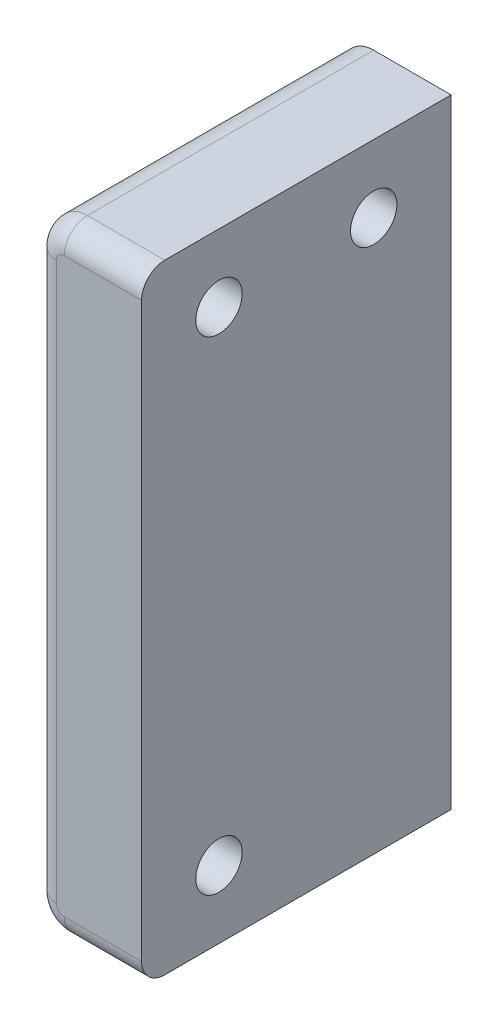
ISO-10303-21;
HEADER;
FILE_DESCRIPTION(('STEP AP214'),'2;1');
FILE_NAME('part.step','',(''),(''),'','','');
FILE_SCHEMA(('AUTOMOTIVE_DESIGN { 1 0 10303 214 1 1 1 1 }'));
ENDSEC;
DATA;
#1=APPLICATION_CONTEXT('core data for automotive mechanical design processes');
#2=APPLICATION_PROTOCOL_DEFINITION('international standard','automotive_design',2000,#1);
#3=PRODUCT_CONTEXT('',#1,'mechanical');
#4=PRODUCT('Part','Part','',(#3));
#5=PRODUCT_RELATED_PRODUCT_CATEGORY('part','',(#4));
#6=PRODUCT_DEFINITION_FORMATION('','',#4);
#7=PRODUCT_DEFINITION_CONTEXT('part definition',#1,'design');
#8=PRODUCT_DEFINITION('design','',#6,#7);
#9=PRODUCT_DEFINITION_SHAPE('','',#8);
#10=(LENGTH_UNIT() NAMED_UNIT(*) SI_UNIT(.MILLI.,.METRE.));
#11=(NAMED_UNIT(*) PLANE_ANGLE_UNIT() SI_UNIT($,.RADIAN.));
#12=(NAMED_UNIT(*) SI_UNIT($,.STERADIAN.) SOLID_ANGLE_UNIT());
#13=UNCERTAINTY_MEASURE_WITH_UNIT(LENGTH_MEASURE(1.E-05),#10,'distance_accuracy_value','');
#14=(GEOMETRIC_REPRESENTATION_CONTEXT(3) GLOBAL_UNCERTAINTY_ASSIGNED_CONTEXT((#13)) GLOBAL_UNIT_ASSIGNED_CONTEXT((#10,
#11,#12)) REPRESENTATION_CONTEXT('',''));
#15=CARTESIAN_POINT('',(0.,0.,0.));
#16=DIRECTION('',(0.,0.,1.));
#17=DIRECTION('',(1.,0.,0.));
#18=AXIS2_PLACEMENT_3D('',#15,#16,#17);
#19=CARTESIAN_POINT('',(-148.000000000001,-28.0000000000001,60.6078810084939));
#20=DIRECTION('',(-1.,0.,0.));
#21=DIRECTION('',(0.,0.,1.));
#22=AXIS2_PLACEMENT_3D('',#19,#20,#21);
#23=PLANE('',#22);
#24=CARTESIAN_POINT('',(-148.000000000001,-63.6250000000001,14.9999999999999));
#25=DIRECTION('',(1.,0.,0.));
#26=DIRECTION('',(0.,0.,-1.));
#27=AXIS2_PLACEMENT_3D('',#24,#25,#26);
#28=CIRCLE('',#27,1.49999999999999);
#29=CARTESIAN_POINT('',(-148.000000000001,-63.6250000000001,13.4999999999999));
#30=VERTEX_POINT('',#29);
#31=EDGE_CURVE('E153',#30,#30,#28,.T.);
#32=ORIENTED_EDGE('',*,*,#31,.F.);
#33=EDGE_LOOP('',(#32));
#34=FACE_BOUND('',#33,.T.);
#35=CARTESIAN_POINT('',(-148.000000000001,-32.3750000000001,5.));
#36=DIRECTION('',(1.,0.,0.));
#37=DIRECTION('',(0.,0.,-1.));
#38=AXIS2_PLACEMENT_3D('',#35,#36,#37);
#39=CIRCLE('',#38,1.50000000000006);
#40=CARTESIAN_POINT('',(-148.000000000001,-32.3750000000001,3.49999999999994));
#41=VERTEX_POINT('',#40);
#42=EDGE_CURVE('E193',#41,#41,#39,.T.);
#43=ORIENTED_EDGE('',*,*,#42,.F.);
#44=EDGE_LOOP('',(#43));
#45=FACE_BOUND('',#44,.T.);
#46=CARTESIAN_POINT('',(-148.000000000001,-32.3750000000001,15.));
#47=DIRECTION('',(1.,0.,0.));
#48=DIRECTION('',(0.,0.,-1.));
#49=AXIS2_PLACEMENT_3D('',#46,#47,#48);
#50=CIRCLE('',#49,1.5);
#51=CARTESIAN_POINT('',(-148.000000000001,-32.3750000000001,13.5));
#52=VERTEX_POINT('',#51);
#53=EDGE_CURVE('E188',#52,#52,#50,.T.);
#54=ORIENTED_EDGE('',*,*,#53,.F.);
#55=EDGE_LOOP('',(#54));
#56=FACE_BOUND('',#55,.T.);
#57=DIRECTION('',(0.,1.,0.));
#58=VECTOR('',#57,1.);
#59=CARTESIAN_POINT('',(-148.000000000001,-28.0000000000001,20.));
#60=LINE('',#59,#58);
#61=CARTESIAN_POINT('',(-148.000000000001,-66.5000000000001,20.));
#62=VERTEX_POINT('',#61);
#63=CARTESIAN_POINT('',(-148.000000000001,-29.5000000000001,20.));
#64=VERTEX_POINT('',#63);
#65=EDGE_CURVE('E123',#62,#64,#60,.T.);
#66=ORIENTED_EDGE('',*,*,#65,.F.);
#67=CARTESIAN_POINT('',(-148.000000000001,-66.5000000000001,18.5));
#68=DIRECTION('',(-1.,0.,0.));
#69=DIRECTION('',(0.,0.,1.));
#70=AXIS2_PLACEMENT_3D('',#67,#68,#69);
#71=CIRCLE('',#70,1.5);
#72=CARTESIAN_POINT('',(-148.000000000001,-68.0000000000001,18.5));
#73=VERTEX_POINT('',#72);
#74=EDGE_CURVE('E110',#62,#73,#71,.F.);
#75=ORIENTED_EDGE('',*,*,#74,.T.);
#76=DIRECTION('',(0.,0.,-1.));
#77=VECTOR('',#76,1.);
#78=CARTESIAN_POINT('',(-148.000000000001,-68.0000000000001,60.6078810084939));
#79=LINE('',#78,#77);
#80=CARTESIAN_POINT('',(-148.000000000001,-68.0000000000001,0.));
#81=VERTEX_POINT('',#80);
#82=EDGE_CURVE('E104',#73,#81,#79,.T.);
#83=ORIENTED_EDGE('',*,*,#82,.T.);
#84=DIRECTION('',(0.,1.,0.));
#85=VECTOR('',#84,1.);
#86=CARTESIAN_POINT('',(-148.000000000001,-28.0000000000001,0.));
#87=LINE('',#86,#85);
#88=CARTESIAN_POINT('',(-148.000000000001,-28.0000000000001,0.));
#89=VERTEX_POINT('',#88);
#90=EDGE_CURVE('E109',#81,#89,#87,.T.);
#91=ORIENTED_EDGE('',*,*,#90,.T.);
#92=DIRECTION('',(0.,0.,-1.));
#93=VECTOR('',#92,1.);
#94=CARTESIAN_POINT('',(-148.000000000001,-28.0000000000001,60.6078810084939));
#95=LINE('',#94,#93);
#96=CARTESIAN_POINT('',(-148.000000000001,-28.0000000000001,18.5));
#97=VERTEX_POINT('',#96);
#98=EDGE_CURVE('E130',#97,#89,#95,.T.);
#99=ORIENTED_EDGE('',*,*,#98,.F.);
#100=CARTESIAN_POINT('',(-148.000000000001,-29.5000000000001,18.5));
#101=DIRECTION('',(-1.,0.,0.));
#102=DIRECTION('',(0.,0.,1.));
#103=AXIS2_PLACEMENT_3D('',#100,#101,#102);
#104=CIRCLE('',#103,1.5);
#105=EDGE_CURVE('E168',#97,#64,#104,.F.);
#106=ORIENTED_EDGE('',*,*,#105,.T.);
#107=EDGE_LOOP('',(#66,#75,#83,#91,#99,#106));
#108=FACE_BOUND('',#107,.T.);
#109=ADVANCED_FACE('F32',(#34,#45,#56,#108),#23,.F.);
#110=CARTESIAN_POINT('',(-148.000000000001,-28.0000000000001,60.6078810084939));
#111=DIRECTION('',(0.,-1.,0.));
#112=DIRECTION('',(1.,0.,0.));
#113=AXIS2_PLACEMENT_3D('',#110,#111,#112);
#114=PLANE('',#113);
#115=DIRECTION('',(0.,0.,-1.));
#116=VECTOR('',#115,1.);
#117=CARTESIAN_POINT('',(-153.000000000001,-28.0000000000001,60.6078810084939));
#118=LINE('',#117,#116);
#119=CARTESIAN_POINT('',(-153.000000000001,-28.0000000000001,18.5));
#120=VERTEX_POINT('',#119);
#121=CARTESIAN_POINT('',(-153.000000000001,-28.0000000000001,0.));
#122=VERTEX_POINT('',#121);
#123=EDGE_CURVE('E139',#120,#122,#118,.T.);
#124=ORIENTED_EDGE('',*,*,#123,.F.);
#125=DIRECTION('',(-1.,0.,0.));
#126=VECTOR('',#125,1.);
#127=CARTESIAN_POINT('',(-148.000000000001,-28.0000000000001,18.5));
#128=LINE('',#127,#126);
#129=EDGE_CURVE('E11',#120,#97,#128,.F.);
#130=ORIENTED_EDGE('',*,*,#129,.T.);
#131=ORIENTED_EDGE('',*,*,#98,.T.);
#132=DIRECTION('',(-1.,0.,0.));
#133=VECTOR('',#132,1.);
#134=CARTESIAN_POINT('',(-148.000000000001,-28.0000000000001,0.));
#135=LINE('',#134,#133);
#136=EDGE_CURVE('E129',#89,#122,#135,.T.);
#137=ORIENTED_EDGE('',*,*,#136,.T.);
#138=EDGE_LOOP('',(#124,#130,#131,#137));
#139=FACE_BOUND('',#138,.T.);
#140=ADVANCED_FACE('F229',(#139),#114,.F.);
#141=CARTESIAN_POINT('',(-153.000000000001,-30.0000000000001,60.6078810084939));
#142=DIRECTION('',(0.,0.,-1.));
#143=DIRECTION('',(-1.,0.,0.));
#144=AXIS2_PLACEMENT_3D('',#141,#142,#143);
#145=CYLINDRICAL_SURFACE('',#144,2.);
#146=DIRECTION('',(0.,0.,-1.));
#147=VECTOR('',#146,1.);
#148=CARTESIAN_POINT('',(-155.000000000001,-30.0000000000001,60.6078810084939));
#149=LINE('',#148,#147);
#150=CARTESIAN_POINT('',(-155.000000000001,-30.0000000000001,18.5));
#151=VERTEX_POINT('',#150);
#152=CARTESIAN_POINT('',(-155.000000000001,-30.0000000000001,0.));
#153=VERTEX_POINT('',#152);
#154=EDGE_CURVE('E142',#151,#153,#149,.T.);
#155=ORIENTED_EDGE('',*,*,#154,.F.);
#156=CARTESIAN_POINT('',(-153.000000000001,-30.0000000000001,18.5));
#157=DIRECTION('',(0.,0.,1.));
#158=DIRECTION('',(1.,0.,0.));
#159=AXIS2_PLACEMENT_3D('',#156,#157,#158);
#160=CIRCLE('',#159,2.);
#161=EDGE_CURVE('E41',#151,#120,#160,.F.);
#162=ORIENTED_EDGE('',*,*,#161,.T.);
#163=ORIENTED_EDGE('',*,*,#123,.T.);
#164=CARTESIAN_POINT('',(-153.000000000001,-30.0000000000001,0.));
#165=DIRECTION('',(0.,0.,1.));
#166=DIRECTION('',(1.,0.,0.));
#167=AXIS2_PLACEMENT_3D('',#164,#165,#166);
#168=CIRCLE('',#167,2.);
#169=EDGE_CURVE('E141',#122,#153,#168,.T.);
#170=ORIENTED_EDGE('',*,*,#169,.T.);
#171=EDGE_LOOP('',(#155,#162,#163,#170));
#172=FACE_BOUND('',#171,.T.);
#173=ADVANCED_FACE('F205',(#172),#145,.T.);
#174=CARTESIAN_POINT('',(-155.000000000001,-30.0000000000001,60.6078810084939));
#175=DIRECTION('',(1.,0.,0.));
#176=DIRECTION('',(0.,0.,-1.));
#177=AXIS2_PLACEMENT_3D('',#174,#175,#176);
#178=PLANE('',#177);
#179=CARTESIAN_POINT('',(-155.000000000001,-63.6250000000001,14.9999999999999));
#180=DIRECTION('',(1.,0.,0.));
#181=DIRECTION('',(0.,0.,-1.));
#182=AXIS2_PLACEMENT_3D('',#179,#180,#181);
#183=CIRCLE('',#182,1.49999999999999);
#184=CARTESIAN_POINT('',(-155.000000000001,-63.6250000000001,13.4999999999999));
#185=VERTEX_POINT('',#184);
#186=EDGE_CURVE('E113',#185,#185,#183,.T.);
#187=ORIENTED_EDGE('',*,*,#186,.T.);
#188=EDGE_LOOP('',(#187));
#189=FACE_BOUND('',#188,.T.);
#190=CARTESIAN_POINT('',(-155.000000000001,-32.3750000000001,5.));
#191=DIRECTION('',(1.,0.,0.));
#192=DIRECTION('',(0.,0.,-1.));
#193=AXIS2_PLACEMENT_3D('',#190,#191,#192);
#194=CIRCLE('',#193,1.50000000000006);
#195=CARTESIAN_POINT('',(-155.000000000001,-32.3750000000001,3.49999999999994));
#196=VERTEX_POINT('',#195);
#197=EDGE_CURVE('E152',#196,#196,#194,.T.);
#198=ORIENTED_EDGE('',*,*,#197,.T.);
#199=EDGE_LOOP('',(#198));
#200=FACE_BOUND('',#199,.T.);
#201=CARTESIAN_POINT('',(-155.000000000001,-32.3750000000001,15.));
#202=DIRECTION('',(1.,0.,0.));
#203=DIRECTION('',(0.,0.,-1.));
#204=AXIS2_PLACEMENT_3D('',#201,#202,#203);
#205=CIRCLE('',#204,1.5);
#206=CARTESIAN_POINT('',(-155.000000000001,-32.3750000000001,13.5));
#207=VERTEX_POINT('',#206);
#208=EDGE_CURVE('E149',#207,#207,#205,.T.);
#209=ORIENTED_EDGE('',*,*,#208,.T.);
#210=EDGE_LOOP('',(#209));
#211=FACE_BOUND('',#210,.T.);
#212=DIRECTION('',(0.,0.,-1.));
#213=VECTOR('',#212,1.);
#214=CARTESIAN_POINT('',(-155.000000000001,-66.0000000000001,60.6078810084939));
#215=LINE('',#214,#213);
#216=CARTESIAN_POINT('',(-155.000000000001,-66.0000000000001,18.5));
#217=VERTEX_POINT('',#216);
#218=CARTESIAN_POINT('',(-155.000000000001,-66.0000000000001,0.));
#219=VERTEX_POINT('',#218);
#220=EDGE_CURVE('E145',#217,#219,#215,.T.);
#221=ORIENTED_EDGE('',*,*,#220,.F.);
#222=DIRECTION('',(0.,-1.,0.));
#223=VECTOR('',#222,1.);
#224=CARTESIAN_POINT('',(-155.000000000001,-30.0000000000001,18.5));
#225=LINE('',#224,#223);
#226=EDGE_CURVE('E56',#217,#151,#225,.F.);
#227=ORIENTED_EDGE('',*,*,#226,.T.);
#228=ORIENTED_EDGE('',*,*,#154,.T.);
#229=DIRECTION('',(0.,-1.,0.));
#230=VECTOR('',#229,1.);
#231=CARTESIAN_POINT('',(-155.000000000001,-30.0000000000001,0.));
#232=LINE('',#231,#230);
#233=EDGE_CURVE('E144',#153,#219,#232,.T.);
#234=ORIENTED_EDGE('',*,*,#233,.T.);
#235=EDGE_LOOP('',(#221,#227,#228,#234));
#236=FACE_BOUND('',#235,.T.);
#237=ADVANCED_FACE('F206',(#189,#200,#211,#236),#178,.F.);
#238=CARTESIAN_POINT('',(-153.000000000001,-66.0000000000001,60.6078810084939));
#239=DIRECTION('',(0.,0.,-1.));
#240=DIRECTION('',(-1.,0.,0.));
#241=AXIS2_PLACEMENT_3D('',#238,#239,#240);
#242=CYLINDRICAL_SURFACE('',#241,2.);
#243=DIRECTION('',(0.,0.,-1.));
#244=VECTOR('',#243,1.);
#245=CARTESIAN_POINT('',(-153.000000000001,-68.0000000000001,60.6078810084939));
#246=LINE('',#245,#244);
#247=CARTESIAN_POINT('',(-153.000000000001,-68.0000000000001,18.5));
#248=VERTEX_POINT('',#247);
#249=CARTESIAN_POINT('',(-153.000000000001,-68.0000000000001,0.));
#250=VERTEX_POINT('',#249);
#251=EDGE_CURVE('E119',#248,#250,#246,.T.);
#252=ORIENTED_EDGE('',*,*,#251,.F.);
#253=CARTESIAN_POINT('',(-153.000000000001,-66.0000000000001,18.5));
#254=DIRECTION('',(0.,0.,1.));
#255=DIRECTION('',(1.,0.,0.));
#256=AXIS2_PLACEMENT_3D('',#253,#254,#255);
#257=CIRCLE('',#256,2.);
#258=EDGE_CURVE('E173',#248,#217,#257,.F.);
#259=ORIENTED_EDGE('',*,*,#258,.T.);
#260=ORIENTED_EDGE('',*,*,#220,.T.);
#261=CARTESIAN_POINT('',(-153.000000000001,-66.0000000000001,0.));
#262=DIRECTION('',(0.,0.,1.));
#263=DIRECTION('',(-1.,0.,0.));
#264=AXIS2_PLACEMENT_3D('',#261,#262,#263);
#265=CIRCLE('',#264,2.);
#266=EDGE_CURVE('E147',#219,#250,#265,.T.);
#267=ORIENTED_EDGE('',*,*,#266,.T.);
#268=EDGE_LOOP('',(#252,#259,#260,#267));
#269=FACE_BOUND('',#268,.T.);
#270=ADVANCED_FACE('F318',(#269),#242,.T.);
#271=CARTESIAN_POINT('',(-148.000000000001,-68.0000000000001,60.6078810084939));
#272=DIRECTION('',(0.,1.,0.));
#273=DIRECTION('',(0.,0.,1.));
#274=AXIS2_PLACEMENT_3D('',#271,#272,#273);
#275=PLANE('',#274);
#276=ORIENTED_EDGE('',*,*,#82,.F.);
#277=DIRECTION('',(1.,0.,0.));
#278=VECTOR('',#277,1.);
#279=CARTESIAN_POINT('',(-153.000000000001,-68.0000000000001,18.5));
#280=LINE('',#279,#278);
#281=EDGE_CURVE('E171',#73,#248,#280,.F.);
#282=ORIENTED_EDGE('',*,*,#281,.T.);
#283=ORIENTED_EDGE('',*,*,#251,.T.);
#284=DIRECTION('',(1.,0.,0.));
#285=VECTOR('',#284,1.);
#286=CARTESIAN_POINT('',(-148.000000000001,-68.0000000000001,0.));
#287=LINE('',#286,#285);
#288=EDGE_CURVE('E116',#250,#81,#287,.T.);
#289=ORIENTED_EDGE('',*,*,#288,.T.);
#290=EDGE_LOOP('',(#276,#282,#283,#289));
#291=FACE_BOUND('',#290,.T.);
#292=ADVANCED_FACE('F117',(#291),#275,.F.);
#293=CARTESIAN_POINT('',(-153.000000000001,-66.0000000000001,0.));
#294=DIRECTION('',(0.,0.,-1.));
#295=DIRECTION('',(-1.,0.,0.));
#296=AXIS2_PLACEMENT_3D('',#293,#294,#295);
#297=PLANE('',#296);
#298=ORIENTED_EDGE('',*,*,#90,.F.);
#299=ORIENTED_EDGE('',*,*,#288,.F.);
#300=ORIENTED_EDGE('',*,*,#266,.F.);
#301=ORIENTED_EDGE('',*,*,#233,.F.);
#302=ORIENTED_EDGE('',*,*,#169,.F.);
#303=ORIENTED_EDGE('',*,*,#136,.F.);
#304=EDGE_LOOP('',(#298,#299,#300,#301,#302,#303));
#305=FACE_BOUND('',#304,.T.);
#306=ADVANCED_FACE('F126',(#305),#297,.T.);
#307=CARTESIAN_POINT('',(0.,0.,20.));
#308=DIRECTION('',(0.,0.,1.));
#309=DIRECTION('',(1.,0.,0.));
#310=AXIS2_PLACEMENT_3D('',#307,#308,#309);
#311=PLANE('',#310);
#312=CARTESIAN_POINT('',(-153.000000000001,-66.0000000000001,20.));
#313=DIRECTION('',(0.,0.,1.));
#314=DIRECTION('',(1.,0.,0.));
#315=AXIS2_PLACEMENT_3D('',#312,#313,#314);
#316=CIRCLE('',#315,0.500000000000002);
#317=CARTESIAN_POINT('',(-153.500000000001,-66.0000000000001,20.));
#318=VERTEX_POINT('',#317);
#319=CARTESIAN_POINT('',(-153.000000000001,-66.5000000000001,20.));
#320=VERTEX_POINT('',#319);
#321=EDGE_CURVE('E163',#318,#320,#316,.T.);
#322=ORIENTED_EDGE('',*,*,#321,.T.);
#323=DIRECTION('',(1.,0.,0.));
#324=VECTOR('',#323,1.);
#325=CARTESIAN_POINT('',(-148.000000000001,-66.5000000000001,20.));
#326=LINE('',#325,#324);
#327=EDGE_CURVE('E165',#320,#62,#326,.T.);
#328=ORIENTED_EDGE('',*,*,#327,.T.);
#329=ORIENTED_EDGE('',*,*,#65,.T.);
#330=DIRECTION('',(-1.,0.,0.));
#331=VECTOR('',#330,1.);
#332=CARTESIAN_POINT('',(-153.000000000001,-29.5000000000001,20.));
#333=LINE('',#332,#331);
#334=CARTESIAN_POINT('',(-153.000000000001,-29.5000000000001,20.));
#335=VERTEX_POINT('',#334);
#336=EDGE_CURVE('E137',#64,#335,#333,.T.);
#337=ORIENTED_EDGE('',*,*,#336,.T.);
#338=CARTESIAN_POINT('',(-153.000000000001,-30.0000000000001,20.));
#339=DIRECTION('',(0.,0.,1.));
#340=DIRECTION('',(1.,0.,0.));
#341=AXIS2_PLACEMENT_3D('',#338,#339,#340);
#342=CIRCLE('',#341,0.5);
#343=CARTESIAN_POINT('',(-153.500000000001,-30.0000000000001,20.));
#344=VERTEX_POINT('',#343);
#345=EDGE_CURVE('E159',#335,#344,#342,.T.);
#346=ORIENTED_EDGE('',*,*,#345,.T.);
#347=DIRECTION('',(0.,-1.,0.));
#348=VECTOR('',#347,1.);
#349=CARTESIAN_POINT('',(-153.500000000001,-66.0000000000001,20.));
#350=LINE('',#349,#348);
#351=EDGE_CURVE('E161',#344,#318,#350,.T.);
#352=ORIENTED_EDGE('',*,*,#351,.T.);
#353=EDGE_LOOP('',(#322,#328,#329,#337,#346,#352));
#354=FACE_BOUND('',#353,.T.);
#355=ADVANCED_FACE('F217',(#354),#311,.T.);
#356=CARTESIAN_POINT('',(-158.000000000001,-32.3750000000001,15.));
#357=DIRECTION('',(1.,0.,0.));
#358=DIRECTION('',(0.,0.,-1.));
#359=AXIS2_PLACEMENT_3D('',#356,#357,#358);
#360=CYLINDRICAL_SURFACE('',#359,1.5);
#361=ORIENTED_EDGE('',*,*,#53,.T.);
#362=EDGE_LOOP('',(#361));
#363=FACE_BOUND('',#362,.T.);
#364=ORIENTED_EDGE('',*,*,#208,.F.);
#365=EDGE_LOOP('',(#364));
#366=FACE_BOUND('',#365,.T.);
#367=ADVANCED_FACE('F243',(#363,#366),#360,.F.);
#368=CARTESIAN_POINT('',(-158.000000000001,-32.3750000000001,5.));
#369=DIRECTION('',(1.,0.,0.));
#370=DIRECTION('',(0.,0.,-1.));
#371=AXIS2_PLACEMENT_3D('',#368,#369,#370);
#372=CYLINDRICAL_SURFACE('',#371,1.50000000000006);
#373=ORIENTED_EDGE('',*,*,#42,.T.);
#374=EDGE_LOOP('',(#373));
#375=FACE_BOUND('',#374,.T.);
#376=ORIENTED_EDGE('',*,*,#197,.F.);
#377=EDGE_LOOP('',(#376));
#378=FACE_BOUND('',#377,.T.);
#379=ADVANCED_FACE('F283',(#375,#378),#372,.F.);
#380=CARTESIAN_POINT('',(-158.000000000001,-63.6250000000001,14.9999999999999));
#381=DIRECTION('',(1.,0.,0.));
#382=DIRECTION('',(0.,0.,-1.));
#383=AXIS2_PLACEMENT_3D('',#380,#381,#382);
#384=CYLINDRICAL_SURFACE('',#383,1.49999999999999);
#385=ORIENTED_EDGE('',*,*,#31,.T.);
#386=EDGE_LOOP('',(#385));
#387=FACE_BOUND('',#386,.T.);
#388=ORIENTED_EDGE('',*,*,#186,.F.);
#389=EDGE_LOOP('',(#388));
#390=FACE_BOUND('',#389,.T.);
#391=ADVANCED_FACE('F226',(#387,#390),#384,.F.);
#392=CARTESIAN_POINT('',(0.,-29.5,18.5));
#393=DIRECTION('',(1.,0.,0.));
#394=DIRECTION('',(0.,1.,0.));
#395=AXIS2_PLACEMENT_3D('',#392,#393,#394);
#396=CYLINDRICAL_SURFACE('',#395,1.5);
#397=ORIENTED_EDGE('',*,*,#105,.F.);
#398=ORIENTED_EDGE('',*,*,#129,.F.);
#399=CARTESIAN_POINT('',(-153.000000000001,-29.5000000000001,18.5));
#400=DIRECTION('',(-1.,0.,0.));
#401=DIRECTION('',(0.,0.,1.));
#402=AXIS2_PLACEMENT_3D('',#399,#400,#401);
#403=CIRCLE('',#402,1.5);
#404=EDGE_CURVE('E36',#335,#120,#403,.T.);
#405=ORIENTED_EDGE('',*,*,#404,.F.);
#406=ORIENTED_EDGE('',*,*,#336,.F.);
#407=EDGE_LOOP('',(#397,#398,#405,#406));
#408=FACE_BOUND('',#407,.T.);
#409=ADVANCED_FACE('F34',(#408),#396,.T.);
#410=CARTESIAN_POINT('',(-153.000000000001,-30.0000000000001,18.5));
#411=DIRECTION('',(0.,0.,1.));
#412=DIRECTION('',(1.,0.,0.));
#413=AXIS2_PLACEMENT_3D('',#410,#411,#412);
#414=DEGENERATE_TOROIDAL_SURFACE('',#413,0.5,1.5,.T.);
#415=ORIENTED_EDGE('',*,*,#404,.T.);
#416=ORIENTED_EDGE('',*,*,#161,.F.);
#417=CARTESIAN_POINT('',(-153.500000000001,-30.0000000000001,18.5));
#418=DIRECTION('',(0.,-1.,0.));
#419=DIRECTION('',(0.,0.,-1.));
#420=AXIS2_PLACEMENT_3D('',#417,#418,#419);
#421=CIRCLE('',#420,1.5);
#422=EDGE_CURVE('E182',#344,#151,#421,.T.);
#423=ORIENTED_EDGE('',*,*,#422,.F.);
#424=ORIENTED_EDGE('',*,*,#345,.F.);
#425=EDGE_LOOP('',(#415,#416,#423,#424));
#426=FACE_BOUND('',#425,.T.);
#427=ADVANCED_FACE('F219',(#426),#414,.T.);
#428=CARTESIAN_POINT('',(-153.500000000001,0.,18.5));
#429=DIRECTION('',(0.,1.,0.));
#430=DIRECTION('',(0.,0.,1.));
#431=AXIS2_PLACEMENT_3D('',#428,#429,#430);
#432=CYLINDRICAL_SURFACE('',#431,1.5);
#433=ORIENTED_EDGE('',*,*,#422,.T.);
#434=ORIENTED_EDGE('',*,*,#226,.F.);
#435=CARTESIAN_POINT('',(-153.500000000001,-66.0000000000001,18.5));
#436=DIRECTION('',(0.,-1.,0.));
#437=DIRECTION('',(0.,0.,-1.));
#438=AXIS2_PLACEMENT_3D('',#435,#436,#437);
#439=CIRCLE('',#438,1.5);
#440=EDGE_CURVE('E180',#318,#217,#439,.T.);
#441=ORIENTED_EDGE('',*,*,#440,.F.);
#442=ORIENTED_EDGE('',*,*,#351,.F.);
#443=EDGE_LOOP('',(#433,#434,#441,#442));
#444=FACE_BOUND('',#443,.T.);
#445=ADVANCED_FACE('F209',(#444),#432,.T.);
#446=CARTESIAN_POINT('',(-153.000000000001,-66.0000000000001,18.5));
#447=DIRECTION('',(0.,0.,1.));
#448=DIRECTION('',(1.,0.,0.));
#449=AXIS2_PLACEMENT_3D('',#446,#447,#448);
#450=DEGENERATE_TOROIDAL_SURFACE('',#449,0.500000000000002,1.5,.T.);
#451=ORIENTED_EDGE('',*,*,#440,.T.);
#452=ORIENTED_EDGE('',*,*,#258,.F.);
#453=CARTESIAN_POINT('',(-153.000000000001,-66.5000000000001,18.5));
#454=DIRECTION('',(1.,0.,0.));
#455=DIRECTION('',(0.,0.,-1.));
#456=AXIS2_PLACEMENT_3D('',#453,#454,#455);
#457=CIRCLE('',#456,1.5);
#458=EDGE_CURVE('E177',#320,#248,#457,.T.);
#459=ORIENTED_EDGE('',*,*,#458,.F.);
#460=ORIENTED_EDGE('',*,*,#321,.F.);
#461=EDGE_LOOP('',(#451,#452,#459,#460));
#462=FACE_BOUND('',#461,.T.);
#463=ADVANCED_FACE('F213',(#462),#450,.T.);
#464=CARTESIAN_POINT('',(0.,-66.5000000000001,18.5));
#465=DIRECTION('',(-1.,0.,0.));
#466=DIRECTION('',(0.,0.,1.));
#467=AXIS2_PLACEMENT_3D('',#464,#465,#466);
#468=CYLINDRICAL_SURFACE('',#467,1.5);
#469=ORIENTED_EDGE('',*,*,#458,.T.);
#470=ORIENTED_EDGE('',*,*,#281,.F.);
#471=ORIENTED_EDGE('',*,*,#74,.F.);
#472=ORIENTED_EDGE('',*,*,#327,.F.);
#473=EDGE_LOOP('',(#469,#470,#471,#472));
#474=FACE_BOUND('',#473,.T.);
#475=ADVANCED_FACE('F244',(#474),#468,.T.);
#476=CLOSED_SHELL('',(#109,#140,#173,#237,#270,#292,#306,#355,#367,#379,#391,#409,#427,#445,
#463,#475));
#477=MANIFOLD_SOLID_BREP('B2',#476);
#478=ADVANCED_BREP_SHAPE_REPRESENTATION('',(#18,#477),#14);
#479=SHAPE_DEFINITION_REPRESENTATION(#9,#478);
ENDSEC;
END-ISO-10303-21;
